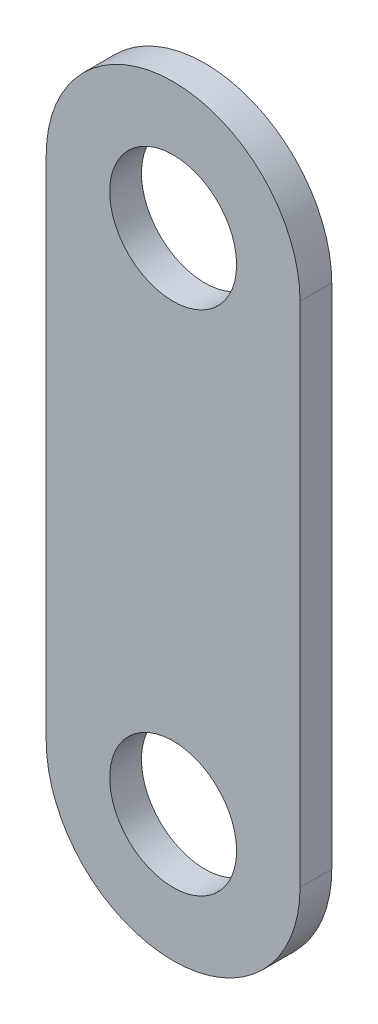
ISO-10303-21;
HEADER;
FILE_DESCRIPTION(('STEP AP214'),'2;1');
FILE_NAME('part.step','',(''),(''),'','','');
FILE_SCHEMA(('AUTOMOTIVE_DESIGN { 1 0 10303 214 1 1 1 1 }'));
ENDSEC;
DATA;
#1=APPLICATION_CONTEXT('core data for automotive mechanical design processes');
#2=APPLICATION_PROTOCOL_DEFINITION('international standard','automotive_design',2000,#1);
#3=PRODUCT_CONTEXT('',#1,'mechanical');
#4=PRODUCT('Part','Part','',(#3));
#5=PRODUCT_RELATED_PRODUCT_CATEGORY('part','',(#4));
#6=PRODUCT_DEFINITION_FORMATION('','',#4);
#7=PRODUCT_DEFINITION_CONTEXT('part definition',#1,'design');
#8=PRODUCT_DEFINITION('design','',#6,#7);
#9=PRODUCT_DEFINITION_SHAPE('','',#8);
#10=(LENGTH_UNIT() NAMED_UNIT(*) SI_UNIT(.MILLI.,.METRE.));
#11=(NAMED_UNIT(*) PLANE_ANGLE_UNIT() SI_UNIT($,.RADIAN.));
#12=(NAMED_UNIT(*) SI_UNIT($,.STERADIAN.) SOLID_ANGLE_UNIT());
#13=UNCERTAINTY_MEASURE_WITH_UNIT(LENGTH_MEASURE(1.E-05),#10,'distance_accuracy_value','');
#14=(GEOMETRIC_REPRESENTATION_CONTEXT(3) GLOBAL_UNCERTAINTY_ASSIGNED_CONTEXT((#13)) GLOBAL_UNIT_ASSIGNED_CONTEXT((#10,
#11,#12)) REPRESENTATION_CONTEXT('',''));
#15=CARTESIAN_POINT('',(0.,0.,0.));
#16=DIRECTION('',(0.,0.,1.));
#17=DIRECTION('',(1.,0.,0.));
#18=AXIS2_PLACEMENT_3D('',#15,#16,#17);
#19=CARTESIAN_POINT('',(-17.2132228705165,25.7423488980835,3.175));
#20=DIRECTION('',(0.,0.,-1.));
#21=DIRECTION('',(-1.,0.,0.));
#22=AXIS2_PLACEMENT_3D('',#19,#20,#21);
#23=CYLINDRICAL_SURFACE('',#22,12.7);
#24=CARTESIAN_POINT('',(-17.2132228705165,25.7423488980835,0.));
#25=DIRECTION('',(0.,0.,1.));
#26=DIRECTION('',(1.,0.,0.));
#27=AXIS2_PLACEMENT_3D('',#24,#25,#26);
#28=CIRCLE('',#27,12.7);
#29=CARTESIAN_POINT('',(-4.51322287051645,25.7423488980835,0.));
#30=VERTEX_POINT('',#29);
#31=CARTESIAN_POINT('',(-29.9132228705164,25.7423488980835,0.));
#32=VERTEX_POINT('',#31);
#33=EDGE_CURVE('E109',#30,#32,#28,.T.);
#34=ORIENTED_EDGE('',*,*,#33,.T.);
#35=DIRECTION('',(0.,0.,-1.));
#36=VECTOR('',#35,1.);
#37=CARTESIAN_POINT('',(-29.9132228705164,25.7423488980835,3.175));
#38=LINE('',#37,#36);
#39=CARTESIAN_POINT('',(-29.9132228705164,25.7423488980835,3.175));
#40=VERTEX_POINT('',#39);
#41=EDGE_CURVE('E11',#40,#32,#38,.T.);
#42=ORIENTED_EDGE('',*,*,#41,.F.);
#43=CARTESIAN_POINT('',(-17.2132228705165,25.7423488980835,3.175));
#44=DIRECTION('',(0.,0.,1.));
#45=DIRECTION('',(1.,0.,0.));
#46=AXIS2_PLACEMENT_3D('',#43,#44,#45);
#47=CIRCLE('',#46,12.7);
#48=CARTESIAN_POINT('',(-4.51322287051645,25.7423488980835,3.175));
#49=VERTEX_POINT('',#48);
#50=EDGE_CURVE('E78',#49,#40,#47,.T.);
#51=ORIENTED_EDGE('',*,*,#50,.F.);
#52=DIRECTION('',(0.,0.,-1.));
#53=VECTOR('',#52,1.);
#54=CARTESIAN_POINT('',(-4.51322287051645,25.7423488980835,3.175));
#55=LINE('',#54,#53);
#56=EDGE_CURVE('E53',#49,#30,#55,.T.);
#57=ORIENTED_EDGE('',*,*,#56,.T.);
#58=EDGE_LOOP('',(#34,#42,#51,#57));
#59=FACE_BOUND('',#58,.T.);
#60=ADVANCED_FACE('F36',(#59),#23,.T.);
#61=CARTESIAN_POINT('',(-29.9132228705164,0.,3.175));
#62=DIRECTION('',(-1.,0.,0.));
#63=DIRECTION('',(0.,0.,1.));
#64=AXIS2_PLACEMENT_3D('',#61,#62,#63);
#65=PLANE('',#64);
#66=DIRECTION('',(0.,1.,0.));
#67=VECTOR('',#66,1.);
#68=CARTESIAN_POINT('',(-29.9132228705164,0.,0.));
#69=LINE('',#68,#67);
#70=CARTESIAN_POINT('',(-29.9132228705164,-25.0576511019165,0.));
#71=VERTEX_POINT('',#70);
#72=EDGE_CURVE('E88',#71,#32,#69,.T.);
#73=ORIENTED_EDGE('',*,*,#72,.F.);
#74=DIRECTION('',(0.,0.,-1.));
#75=VECTOR('',#74,1.);
#76=CARTESIAN_POINT('',(-29.9132228705164,-25.0576511019165,3.175));
#77=LINE('',#76,#75);
#78=CARTESIAN_POINT('',(-29.9132228705164,-25.0576511019165,3.175));
#79=VERTEX_POINT('',#78);
#80=EDGE_CURVE('E45',#79,#71,#77,.T.);
#81=ORIENTED_EDGE('',*,*,#80,.F.);
#82=DIRECTION('',(0.,1.,0.));
#83=VECTOR('',#82,1.);
#84=CARTESIAN_POINT('',(-29.9132228705164,0.,3.175));
#85=LINE('',#84,#83);
#86=EDGE_CURVE('E86',#79,#40,#85,.T.);
#87=ORIENTED_EDGE('',*,*,#86,.T.);
#88=ORIENTED_EDGE('',*,*,#41,.T.);
#89=EDGE_LOOP('',(#73,#81,#87,#88));
#90=FACE_BOUND('',#89,.T.);
#91=ADVANCED_FACE('F85',(#90),#65,.T.);
#92=CARTESIAN_POINT('',(-17.2132228705164,-25.0576511019165,3.175));
#93=DIRECTION('',(0.,0.,-1.));
#94=DIRECTION('',(-1.,0.,0.));
#95=AXIS2_PLACEMENT_3D('',#92,#93,#94);
#96=CYLINDRICAL_SURFACE('',#95,12.7);
#97=CARTESIAN_POINT('',(-17.2132228705164,-25.0576511019165,0.));
#98=DIRECTION('',(0.,0.,1.));
#99=DIRECTION('',(1.,0.,0.));
#100=AXIS2_PLACEMENT_3D('',#97,#98,#99);
#101=CIRCLE('',#100,12.7);
#102=CARTESIAN_POINT('',(-4.51322287051645,-25.0576511019165,0.));
#103=VERTEX_POINT('',#102);
#104=EDGE_CURVE('E112',#71,#103,#101,.T.);
#105=ORIENTED_EDGE('',*,*,#104,.T.);
#106=DIRECTION('',(0.,0.,-1.));
#107=VECTOR('',#106,1.);
#108=CARTESIAN_POINT('',(-4.51322287051645,-25.0576511019165,3.175));
#109=LINE('',#108,#107);
#110=CARTESIAN_POINT('',(-4.51322287051645,-25.0576511019165,3.175));
#111=VERTEX_POINT('',#110);
#112=EDGE_CURVE('E67',#111,#103,#109,.T.);
#113=ORIENTED_EDGE('',*,*,#112,.F.);
#114=CARTESIAN_POINT('',(-17.2132228705164,-25.0576511019165,3.175));
#115=DIRECTION('',(0.,0.,1.));
#116=DIRECTION('',(1.,0.,0.));
#117=AXIS2_PLACEMENT_3D('',#114,#115,#116);
#118=CIRCLE('',#117,12.7);
#119=EDGE_CURVE('E91',#79,#111,#118,.T.);
#120=ORIENTED_EDGE('',*,*,#119,.F.);
#121=ORIENTED_EDGE('',*,*,#80,.T.);
#122=EDGE_LOOP('',(#105,#113,#120,#121));
#123=FACE_BOUND('',#122,.T.);
#124=ADVANCED_FACE('F92',(#123),#96,.T.);
#125=CARTESIAN_POINT('',(-4.51322287051645,0.,3.175));
#126=DIRECTION('',(1.,0.,0.));
#127=DIRECTION('',(0.,0.,-1.));
#128=AXIS2_PLACEMENT_3D('',#125,#126,#127);
#129=PLANE('',#128);
#130=DIRECTION('',(0.,-1.,0.));
#131=VECTOR('',#130,1.);
#132=CARTESIAN_POINT('',(-4.51322287051645,0.,0.));
#133=LINE('',#132,#131);
#134=EDGE_CURVE('E114',#30,#103,#133,.T.);
#135=ORIENTED_EDGE('',*,*,#134,.F.);
#136=ORIENTED_EDGE('',*,*,#56,.F.);
#137=DIRECTION('',(0.,-1.,0.));
#138=VECTOR('',#137,1.);
#139=CARTESIAN_POINT('',(-4.51322287051645,0.,3.175));
#140=LINE('',#139,#138);
#141=EDGE_CURVE('E93',#49,#111,#140,.T.);
#142=ORIENTED_EDGE('',*,*,#141,.T.);
#143=ORIENTED_EDGE('',*,*,#112,.T.);
#144=EDGE_LOOP('',(#135,#136,#142,#143));
#145=FACE_BOUND('',#144,.T.);
#146=ADVANCED_FACE('F148',(#145),#129,.T.);
#147=CARTESIAN_POINT('',(-17.2132228705165,25.7423488980835,3.175));
#148=DIRECTION('',(0.,0.,-1.));
#149=DIRECTION('',(-1.,0.,0.));
#150=AXIS2_PLACEMENT_3D('',#147,#148,#149);
#151=CYLINDRICAL_SURFACE('',#150,6.35);
#152=CARTESIAN_POINT('',(-17.2132228705165,25.7423488980835,3.175));
#153=DIRECTION('',(0.,0.,1.));
#154=DIRECTION('',(1.,0.,0.));
#155=AXIS2_PLACEMENT_3D('',#152,#153,#154);
#156=CIRCLE('',#155,6.35);
#157=CARTESIAN_POINT('',(-10.8632228705165,25.7423488980835,3.175));
#158=VERTEX_POINT('',#157);
#159=EDGE_CURVE('E98',#158,#158,#156,.T.);
#160=ORIENTED_EDGE('',*,*,#159,.T.);
#161=EDGE_LOOP('',(#160));
#162=FACE_BOUND('',#161,.T.);
#163=CARTESIAN_POINT('',(-17.2132228705165,25.7423488980835,0.));
#164=DIRECTION('',(0.,0.,1.));
#165=DIRECTION('',(1.,0.,0.));
#166=AXIS2_PLACEMENT_3D('',#163,#164,#165);
#167=CIRCLE('',#166,6.35);
#168=CARTESIAN_POINT('',(-10.8632228705165,25.7423488980835,0.));
#169=VERTEX_POINT('',#168);
#170=EDGE_CURVE('E106',#169,#169,#167,.T.);
#171=ORIENTED_EDGE('',*,*,#170,.F.);
#172=EDGE_LOOP('',(#171));
#173=FACE_BOUND('',#172,.T.);
#174=ADVANCED_FACE('F38',(#162,#173),#151,.F.);
#175=CARTESIAN_POINT('',(-17.2132228705164,-25.0576511019165,3.175));
#176=DIRECTION('',(0.,0.,-1.));
#177=DIRECTION('',(-1.,0.,0.));
#178=AXIS2_PLACEMENT_3D('',#175,#176,#177);
#179=CYLINDRICAL_SURFACE('',#178,6.35);
#180=CARTESIAN_POINT('',(-17.2132228705164,-25.0576511019165,3.175));
#181=DIRECTION('',(0.,0.,1.));
#182=DIRECTION('',(1.,0.,0.));
#183=AXIS2_PLACEMENT_3D('',#180,#181,#182);
#184=CIRCLE('',#183,6.35);
#185=CARTESIAN_POINT('',(-10.8632228705164,-25.0576511019165,3.175));
#186=VERTEX_POINT('',#185);
#187=EDGE_CURVE('E103',#186,#186,#184,.T.);
#188=ORIENTED_EDGE('',*,*,#187,.T.);
#189=EDGE_LOOP('',(#188));
#190=FACE_BOUND('',#189,.T.);
#191=CARTESIAN_POINT('',(-17.2132228705164,-25.0576511019165,0.));
#192=DIRECTION('',(0.,0.,1.));
#193=DIRECTION('',(1.,0.,0.));
#194=AXIS2_PLACEMENT_3D('',#191,#192,#193);
#195=CIRCLE('',#194,6.35);
#196=CARTESIAN_POINT('',(-10.8632228705164,-25.0576511019165,0.));
#197=VERTEX_POINT('',#196);
#198=EDGE_CURVE('E117',#197,#197,#195,.T.);
#199=ORIENTED_EDGE('',*,*,#198,.F.);
#200=EDGE_LOOP('',(#199));
#201=FACE_BOUND('',#200,.T.);
#202=ADVANCED_FACE('F130',(#190,#201),#179,.F.);
#203=CARTESIAN_POINT('',(0.,0.,3.175));
#204=DIRECTION('',(0.,0.,1.));
#205=DIRECTION('',(1.,0.,0.));
#206=AXIS2_PLACEMENT_3D('',#203,#204,#205);
#207=PLANE('',#206);
#208=ORIENTED_EDGE('',*,*,#159,.F.);
#209=EDGE_LOOP('',(#208));
#210=FACE_BOUND('',#209,.T.);
#211=ORIENTED_EDGE('',*,*,#50,.T.);
#212=ORIENTED_EDGE('',*,*,#86,.F.);
#213=ORIENTED_EDGE('',*,*,#119,.T.);
#214=ORIENTED_EDGE('',*,*,#141,.F.);
#215=EDGE_LOOP('',(#211,#212,#213,#214));
#216=FACE_BOUND('',#215,.T.);
#217=ORIENTED_EDGE('',*,*,#187,.F.);
#218=EDGE_LOOP('',(#217));
#219=FACE_BOUND('',#218,.T.);
#220=ADVANCED_FACE('F95',(#210,#216,#219),#207,.T.);
#221=CARTESIAN_POINT('',(0.,0.,0.));
#222=DIRECTION('',(0.,0.,1.));
#223=DIRECTION('',(1.,0.,0.));
#224=AXIS2_PLACEMENT_3D('',#221,#222,#223);
#225=PLANE('',#224);
#226=ORIENTED_EDGE('',*,*,#170,.T.);
#227=EDGE_LOOP('',(#226));
#228=FACE_BOUND('',#227,.T.);
#229=ORIENTED_EDGE('',*,*,#33,.F.);
#230=ORIENTED_EDGE('',*,*,#134,.T.);
#231=ORIENTED_EDGE('',*,*,#104,.F.);
#232=ORIENTED_EDGE('',*,*,#72,.T.);
#233=EDGE_LOOP('',(#229,#230,#231,#232));
#234=FACE_BOUND('',#233,.T.);
#235=ORIENTED_EDGE('',*,*,#198,.T.);
#236=EDGE_LOOP('',(#235));
#237=FACE_BOUND('',#236,.T.);
#238=ADVANCED_FACE('F129',(#228,#234,#237),#225,.F.);
#239=CLOSED_SHELL('',(#60,#91,#124,#146,#174,#202,#220,#238));
#240=MANIFOLD_SOLID_BREP('B2',#239);
#241=ADVANCED_BREP_SHAPE_REPRESENTATION('',(#18,#240),#14);
#242=SHAPE_DEFINITION_REPRESENTATION(#9,#241);
ENDSEC;
END-ISO-10303-21;
